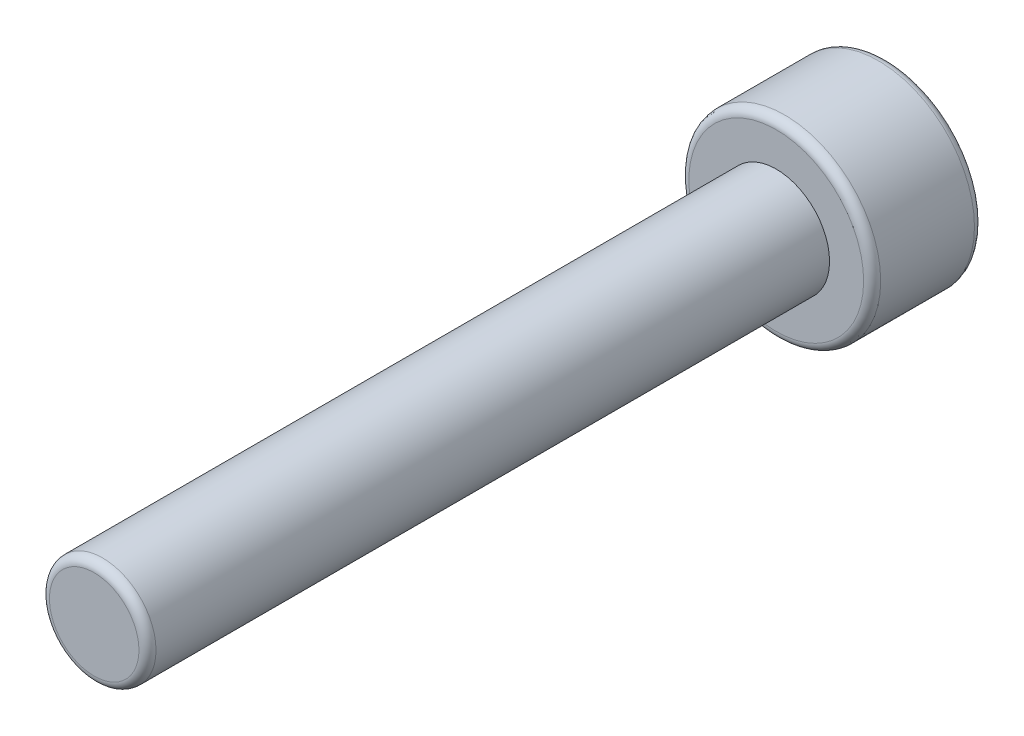
ISO-10303-21;
HEADER;
FILE_DESCRIPTION(('STEP AP214'),'2;1');
FILE_NAME('part.step','',(''),(''),'','','');
FILE_SCHEMA(('AUTOMOTIVE_DESIGN { 1 0 10303 214 1 1 1 1 }'));
ENDSEC;
DATA;
#1=APPLICATION_CONTEXT('core data for automotive mechanical design processes');
#2=APPLICATION_PROTOCOL_DEFINITION('international standard','automotive_design',2000,#1);
#3=PRODUCT_CONTEXT('',#1,'mechanical');
#4=PRODUCT('Part','Part','',(#3));
#5=PRODUCT_RELATED_PRODUCT_CATEGORY('part','',(#4));
#6=PRODUCT_DEFINITION_FORMATION('','',#4);
#7=PRODUCT_DEFINITION_CONTEXT('part definition',#1,'design');
#8=PRODUCT_DEFINITION('design','',#6,#7);
#9=PRODUCT_DEFINITION_SHAPE('','',#8);
#10=(LENGTH_UNIT() NAMED_UNIT(*) SI_UNIT(.MILLI.,.METRE.));
#11=(NAMED_UNIT(*) PLANE_ANGLE_UNIT() SI_UNIT($,.RADIAN.));
#12=(NAMED_UNIT(*) SI_UNIT($,.STERADIAN.) SOLID_ANGLE_UNIT());
#13=UNCERTAINTY_MEASURE_WITH_UNIT(LENGTH_MEASURE(1.E-05),#10,'distance_accuracy_value','');
#14=(GEOMETRIC_REPRESENTATION_CONTEXT(3) GLOBAL_UNCERTAINTY_ASSIGNED_CONTEXT((#13)) GLOBAL_UNIT_ASSIGNED_CONTEXT((#10,
#11,#12)) REPRESENTATION_CONTEXT('',''));
#15=CARTESIAN_POINT('',(0.,0.,0.));
#16=DIRECTION('',(0.,0.,1.));
#17=DIRECTION('',(1.,0.,0.));
#18=AXIS2_PLACEMENT_3D('',#15,#16,#17);
#19=CARTESIAN_POINT('',(0.,0.,16.));
#20=DIRECTION('',(0.,0.,-1.));
#21=DIRECTION('',(-1.,0.,0.));
#22=AXIS2_PLACEMENT_3D('',#19,#20,#21);
#23=CYLINDRICAL_SURFACE('',#22,1.25);
#24=CARTESIAN_POINT('',(0.,0.,15.8));
#25=DIRECTION('',(0.,0.,1.));
#26=DIRECTION('',(1.,0.,0.));
#27=AXIS2_PLACEMENT_3D('',#24,#25,#26);
#28=CIRCLE('',#27,1.25);
#29=CARTESIAN_POINT('',(1.25,0.,15.8));
#30=VERTEX_POINT('',#29);
#31=EDGE_CURVE('E173',#30,#30,#28,.F.);
#32=ORIENTED_EDGE('',*,*,#31,.T.);
#33=EDGE_LOOP('',(#32));
#34=FACE_BOUND('',#33,.T.);
#35=CARTESIAN_POINT('',(0.,0.,0.));
#36=DIRECTION('',(0.,0.,1.));
#37=DIRECTION('',(1.,0.,0.));
#38=AXIS2_PLACEMENT_3D('',#35,#36,#37);
#39=CIRCLE('',#38,1.25);
#40=CARTESIAN_POINT('',(1.25,0.,0.));
#41=VERTEX_POINT('',#40);
#42=EDGE_CURVE('E156',#41,#41,#39,.T.);
#43=ORIENTED_EDGE('',*,*,#42,.T.);
#44=EDGE_LOOP('',(#43));
#45=FACE_BOUND('',#44,.T.);
#46=ADVANCED_FACE('F41',(#34,#45),#23,.T.);
#47=CARTESIAN_POINT('',(0.,0.,16.));
#48=DIRECTION('',(0.,0.,1.));
#49=DIRECTION('',(1.,0.,0.));
#50=AXIS2_PLACEMENT_3D('',#47,#48,#49);
#51=PLANE('',#50);
#52=CARTESIAN_POINT('',(0.,0.,16.));
#53=DIRECTION('',(0.,0.,1.));
#54=DIRECTION('',(1.,0.,0.));
#55=AXIS2_PLACEMENT_3D('',#52,#53,#54);
#56=CIRCLE('',#55,1.05);
#57=CARTESIAN_POINT('',(1.05,0.,16.));
#58=VERTEX_POINT('',#57);
#59=EDGE_CURVE('E169',#58,#58,#56,.T.);
#60=ORIENTED_EDGE('',*,*,#59,.T.);
#61=EDGE_LOOP('',(#60));
#62=FACE_BOUND('',#61,.T.);
#63=ADVANCED_FACE('F206',(#62),#51,.T.);
#64=CARTESIAN_POINT('',(0.,0.,-2.6));
#65=DIRECTION('',(0.,0.,1.));
#66=DIRECTION('',(1.,0.,0.));
#67=AXIS2_PLACEMENT_3D('',#64,#65,#66);
#68=CYLINDRICAL_SURFACE('',#67,2.25);
#69=CARTESIAN_POINT('',(0.,0.,-0.2));
#70=DIRECTION('',(0.,0.,1.));
#71=DIRECTION('',(1.,0.,0.));
#72=AXIS2_PLACEMENT_3D('',#69,#70,#71);
#73=CIRCLE('',#72,2.25);
#74=CARTESIAN_POINT('',(2.25,0.,-0.2));
#75=VERTEX_POINT('',#74);
#76=EDGE_CURVE('E50',#75,#75,#73,.F.);
#77=ORIENTED_EDGE('',*,*,#76,.T.);
#78=EDGE_LOOP('',(#77));
#79=FACE_BOUND('',#78,.T.);
#80=CARTESIAN_POINT('',(0.,0.,-2.4));
#81=DIRECTION('',(0.,0.,1.));
#82=DIRECTION('',(1.,0.,0.));
#83=AXIS2_PLACEMENT_3D('',#80,#81,#82);
#84=CIRCLE('',#83,2.25);
#85=CARTESIAN_POINT('',(2.25,0.,-2.4));
#86=VERTEX_POINT('',#85);
#87=EDGE_CURVE('E181',#86,#86,#84,.T.);
#88=ORIENTED_EDGE('',*,*,#87,.T.);
#89=EDGE_LOOP('',(#88));
#90=FACE_BOUND('',#89,.T.);
#91=ADVANCED_FACE('F188',(#79,#90),#68,.T.);
#92=CARTESIAN_POINT('',(0.,0.,-2.6));
#93=DIRECTION('',(0.,0.,1.));
#94=DIRECTION('',(1.,0.,0.));
#95=AXIS2_PLACEMENT_3D('',#92,#93,#94);
#96=PLANE('',#95);
#97=CARTESIAN_POINT('',(0.,0.,-2.6));
#98=DIRECTION('',(0.,0.,1.));
#99=DIRECTION('',(1.,0.,0.));
#100=AXIS2_PLACEMENT_3D('',#97,#98,#99);
#101=CIRCLE('',#100,2.05);
#102=CARTESIAN_POINT('',(2.05,0.,-2.6));
#103=VERTEX_POINT('',#102);
#104=EDGE_CURVE('E11',#103,#103,#101,.F.);
#105=ORIENTED_EDGE('',*,*,#104,.T.);
#106=EDGE_LOOP('',(#105));
#107=FACE_BOUND('',#106,.T.);
#108=DIRECTION('',(0.866025403784439,-0.5,0.));
#109=VECTOR('',#108,1.);
#110=CARTESIAN_POINT('',(0.,1.15470053837925,-2.6));
#111=LINE('',#110,#109);
#112=CARTESIAN_POINT('',(0.,1.15470053837925,-2.6));
#113=VERTEX_POINT('',#112);
#114=CARTESIAN_POINT('',(1.,0.577350269189626,-2.6));
#115=VERTEX_POINT('',#114);
#116=EDGE_CURVE('E137',#113,#115,#111,.T.);
#117=ORIENTED_EDGE('',*,*,#116,.F.);
#118=DIRECTION('',(0.866025403784439,0.5,0.));
#119=VECTOR('',#118,1.);
#120=CARTESIAN_POINT('',(-0.999999999999999,0.577350269189626,-2.6));
#121=LINE('',#120,#119);
#122=CARTESIAN_POINT('',(-0.999999999999999,0.577350269189626,-2.6));
#123=VERTEX_POINT('',#122);
#124=EDGE_CURVE('E57',#123,#113,#121,.T.);
#125=ORIENTED_EDGE('',*,*,#124,.F.);
#126=DIRECTION('',(0.,1.,0.));
#127=VECTOR('',#126,1.);
#128=CARTESIAN_POINT('',(-0.999999999999999,-0.577350269189626,-2.6));
#129=LINE('',#128,#127);
#130=CARTESIAN_POINT('',(-0.999999999999999,-0.577350269189626,-2.6));
#131=VERTEX_POINT('',#130);
#132=EDGE_CURVE('E150',#131,#123,#129,.T.);
#133=ORIENTED_EDGE('',*,*,#132,.F.);
#134=DIRECTION('',(-0.866025403784439,0.5,0.));
#135=VECTOR('',#134,1.);
#136=CARTESIAN_POINT('',(0.,-1.15470053837925,-2.6));
#137=LINE('',#136,#135);
#138=CARTESIAN_POINT('',(0.,-1.15470053837925,-2.6));
#139=VERTEX_POINT('',#138);
#140=EDGE_CURVE('E147',#139,#131,#137,.T.);
#141=ORIENTED_EDGE('',*,*,#140,.F.);
#142=DIRECTION('',(-0.866025403784439,-0.5,0.));
#143=VECTOR('',#142,1.);
#144=CARTESIAN_POINT('',(1.,-0.577350269189626,-2.6));
#145=LINE('',#144,#143);
#146=CARTESIAN_POINT('',(1.,-0.577350269189626,-2.6));
#147=VERTEX_POINT('',#146);
#148=EDGE_CURVE('E105',#147,#139,#145,.T.);
#149=ORIENTED_EDGE('',*,*,#148,.F.);
#150=DIRECTION('',(0.,-1.,0.));
#151=VECTOR('',#150,1.);
#152=CARTESIAN_POINT('',(1.,0.577350269189626,-2.6));
#153=LINE('',#152,#151);
#154=EDGE_CURVE('E141',#115,#147,#153,.T.);
#155=ORIENTED_EDGE('',*,*,#154,.F.);
#156=EDGE_LOOP('',(#117,#125,#133,#141,#149,#155));
#157=FACE_BOUND('',#156,.T.);
#158=ADVANCED_FACE('F201',(#107,#157),#96,.F.);
#159=CARTESIAN_POINT('',(0.,0.,0.));
#160=DIRECTION('',(0.,0.,1.));
#161=DIRECTION('',(1.,0.,0.));
#162=AXIS2_PLACEMENT_3D('',#159,#160,#161);
#163=PLANE('',#162);
#164=CARTESIAN_POINT('',(0.,0.,0.));
#165=DIRECTION('',(0.,0.,1.));
#166=DIRECTION('',(1.,0.,0.));
#167=AXIS2_PLACEMENT_3D('',#164,#165,#166);
#168=CIRCLE('',#167,2.05);
#169=CARTESIAN_POINT('',(2.05,0.,0.));
#170=VERTEX_POINT('',#169);
#171=EDGE_CURVE('E177',#170,#170,#168,.T.);
#172=ORIENTED_EDGE('',*,*,#171,.T.);
#173=EDGE_LOOP('',(#172));
#174=FACE_BOUND('',#173,.T.);
#175=ORIENTED_EDGE('',*,*,#42,.F.);
#176=EDGE_LOOP('',(#175));
#177=FACE_BOUND('',#176,.T.);
#178=ADVANCED_FACE('F197',(#174,#177),#163,.T.);
#179=CARTESIAN_POINT('',(-0.999999999999999,0.577350269189626,-1.2));
#180=DIRECTION('',(-0.5,0.866025403784439,0.));
#181=DIRECTION('',(-0.866025403784439,-0.5,0.));
#182=AXIS2_PLACEMENT_3D('',#179,#180,#181);
#183=PLANE('',#182);
#184=ORIENTED_EDGE('',*,*,#124,.T.);
#185=DIRECTION('',(0.,0.,-1.));
#186=VECTOR('',#185,1.);
#187=CARTESIAN_POINT('',(0.,1.15470053837925,-1.2));
#188=LINE('',#187,#186);
#189=CARTESIAN_POINT('',(0.,1.15470053837925,-1.2));
#190=VERTEX_POINT('',#189);
#191=EDGE_CURVE('E87',#190,#113,#188,.T.);
#192=ORIENTED_EDGE('',*,*,#191,.F.);
#193=DIRECTION('',(0.866025403784439,0.5,0.));
#194=VECTOR('',#193,1.);
#195=CARTESIAN_POINT('',(-0.999999999999999,0.577350269189626,-1.2));
#196=LINE('',#195,#194);
#197=CARTESIAN_POINT('',(-0.999999999999999,0.577350269189626,-1.2));
#198=VERTEX_POINT('',#197);
#199=EDGE_CURVE('E153',#198,#190,#196,.T.);
#200=ORIENTED_EDGE('',*,*,#199,.F.);
#201=DIRECTION('',(0.,0.,-1.));
#202=VECTOR('',#201,1.);
#203=CARTESIAN_POINT('',(-0.999999999999999,0.577350269189626,-1.2));
#204=LINE('',#203,#202);
#205=EDGE_CURVE('E65',#198,#123,#204,.T.);
#206=ORIENTED_EDGE('',*,*,#205,.T.);
#207=EDGE_LOOP('',(#184,#192,#200,#206));
#208=FACE_BOUND('',#207,.T.);
#209=ADVANCED_FACE('F200',(#208),#183,.F.);
#210=CARTESIAN_POINT('',(-0.999999999999999,-0.577350269189626,-1.2));
#211=DIRECTION('',(-1.,0.,0.));
#212=DIRECTION('',(0.,0.,1.));
#213=AXIS2_PLACEMENT_3D('',#210,#211,#212);
#214=PLANE('',#213);
#215=ORIENTED_EDGE('',*,*,#132,.T.);
#216=ORIENTED_EDGE('',*,*,#205,.F.);
#217=DIRECTION('',(0.,1.,0.));
#218=VECTOR('',#217,1.);
#219=CARTESIAN_POINT('',(-0.999999999999999,-0.577350269189626,-1.2));
#220=LINE('',#219,#218);
#221=CARTESIAN_POINT('',(-0.999999999999999,-0.577350269189626,-1.2));
#222=VERTEX_POINT('',#221);
#223=EDGE_CURVE('E119',#222,#198,#220,.T.);
#224=ORIENTED_EDGE('',*,*,#223,.F.);
#225=DIRECTION('',(0.,0.,-1.));
#226=VECTOR('',#225,1.);
#227=CARTESIAN_POINT('',(-0.999999999999999,-0.577350269189626,-1.2));
#228=LINE('',#227,#226);
#229=EDGE_CURVE('E110',#222,#131,#228,.T.);
#230=ORIENTED_EDGE('',*,*,#229,.T.);
#231=EDGE_LOOP('',(#215,#216,#224,#230));
#232=FACE_BOUND('',#231,.T.);
#233=ADVANCED_FACE('F233',(#232),#214,.F.);
#234=CARTESIAN_POINT('',(0.,-1.15470053837925,-1.2));
#235=DIRECTION('',(-0.5,-0.866025403784439,0.));
#236=DIRECTION('',(0.866025403784439,-0.5,0.));
#237=AXIS2_PLACEMENT_3D('',#234,#235,#236);
#238=PLANE('',#237);
#239=ORIENTED_EDGE('',*,*,#140,.T.);
#240=ORIENTED_EDGE('',*,*,#229,.F.);
#241=DIRECTION('',(-0.866025403784439,0.5,0.));
#242=VECTOR('',#241,1.);
#243=CARTESIAN_POINT('',(0.,-1.15470053837925,-1.2));
#244=LINE('',#243,#242);
#245=CARTESIAN_POINT('',(0.,-1.15470053837925,-1.2));
#246=VERTEX_POINT('',#245);
#247=EDGE_CURVE('E114',#246,#222,#244,.T.);
#248=ORIENTED_EDGE('',*,*,#247,.F.);
#249=DIRECTION('',(0.,0.,-1.));
#250=VECTOR('',#249,1.);
#251=CARTESIAN_POINT('',(0.,-1.15470053837925,-1.2));
#252=LINE('',#251,#250);
#253=EDGE_CURVE('E98',#246,#139,#252,.T.);
#254=ORIENTED_EDGE('',*,*,#253,.T.);
#255=EDGE_LOOP('',(#239,#240,#248,#254));
#256=FACE_BOUND('',#255,.T.);
#257=ADVANCED_FACE('F115',(#256),#238,.F.);
#258=CARTESIAN_POINT('',(1.,-0.577350269189626,-1.2));
#259=DIRECTION('',(0.5,-0.866025403784438,0.));
#260=DIRECTION('',(0.866025403784439,0.5,0.));
#261=AXIS2_PLACEMENT_3D('',#258,#259,#260);
#262=PLANE('',#261);
#263=ORIENTED_EDGE('',*,*,#148,.T.);
#264=ORIENTED_EDGE('',*,*,#253,.F.);
#265=DIRECTION('',(-0.866025403784439,-0.5,0.));
#266=VECTOR('',#265,1.);
#267=CARTESIAN_POINT('',(1.,-0.577350269189626,-1.2));
#268=LINE('',#267,#266);
#269=CARTESIAN_POINT('',(1.,-0.577350269189626,-1.2));
#270=VERTEX_POINT('',#269);
#271=EDGE_CURVE('E102',#270,#246,#268,.T.);
#272=ORIENTED_EDGE('',*,*,#271,.F.);
#273=DIRECTION('',(0.,0.,-1.));
#274=VECTOR('',#273,1.);
#275=CARTESIAN_POINT('',(1.,-0.577350269189626,-1.2));
#276=LINE('',#275,#274);
#277=EDGE_CURVE('E111',#270,#147,#276,.T.);
#278=ORIENTED_EDGE('',*,*,#277,.T.);
#279=EDGE_LOOP('',(#263,#264,#272,#278));
#280=FACE_BOUND('',#279,.T.);
#281=ADVANCED_FACE('F100',(#280),#262,.F.);
#282=CARTESIAN_POINT('',(1.,0.577350269189626,-1.2));
#283=DIRECTION('',(1.,0.,0.));
#284=DIRECTION('',(0.,0.,-1.));
#285=AXIS2_PLACEMENT_3D('',#282,#283,#284);
#286=PLANE('',#285);
#287=ORIENTED_EDGE('',*,*,#154,.T.);
#288=ORIENTED_EDGE('',*,*,#277,.F.);
#289=DIRECTION('',(0.,-1.,0.));
#290=VECTOR('',#289,1.);
#291=CARTESIAN_POINT('',(1.,0.577350269189626,-1.2));
#292=LINE('',#291,#290);
#293=CARTESIAN_POINT('',(1.,0.577350269189626,-1.2));
#294=VERTEX_POINT('',#293);
#295=EDGE_CURVE('E125',#294,#270,#292,.T.);
#296=ORIENTED_EDGE('',*,*,#295,.F.);
#297=DIRECTION('',(0.,0.,-1.));
#298=VECTOR('',#297,1.);
#299=CARTESIAN_POINT('',(1.,0.577350269189626,-1.2));
#300=LINE('',#299,#298);
#301=EDGE_CURVE('E161',#294,#115,#300,.T.);
#302=ORIENTED_EDGE('',*,*,#301,.T.);
#303=EDGE_LOOP('',(#287,#288,#296,#302));
#304=FACE_BOUND('',#303,.T.);
#305=ADVANCED_FACE('F229',(#304),#286,.F.);
#306=CARTESIAN_POINT('',(0.,1.15470053837925,-1.2));
#307=DIRECTION('',(0.5,0.866025403784439,0.));
#308=DIRECTION('',(-0.866025403784439,0.5,0.));
#309=AXIS2_PLACEMENT_3D('',#306,#307,#308);
#310=PLANE('',#309);
#311=ORIENTED_EDGE('',*,*,#116,.T.);
#312=ORIENTED_EDGE('',*,*,#301,.F.);
#313=DIRECTION('',(0.866025403784439,-0.5,0.));
#314=VECTOR('',#313,1.);
#315=CARTESIAN_POINT('',(0.,1.15470053837925,-1.2));
#316=LINE('',#315,#314);
#317=EDGE_CURVE('E129',#190,#294,#316,.T.);
#318=ORIENTED_EDGE('',*,*,#317,.F.);
#319=ORIENTED_EDGE('',*,*,#191,.T.);
#320=EDGE_LOOP('',(#311,#312,#318,#319));
#321=FACE_BOUND('',#320,.T.);
#322=ADVANCED_FACE('F221',(#321),#310,.F.);
#323=CARTESIAN_POINT('',(0.,0.,-1.2));
#324=DIRECTION('',(0.,0.,-1.));
#325=DIRECTION('',(-1.,0.,0.));
#326=AXIS2_PLACEMENT_3D('',#323,#324,#325);
#327=PLANE('',#326);
#328=ORIENTED_EDGE('',*,*,#199,.T.);
#329=ORIENTED_EDGE('',*,*,#317,.T.);
#330=ORIENTED_EDGE('',*,*,#295,.T.);
#331=ORIENTED_EDGE('',*,*,#271,.T.);
#332=ORIENTED_EDGE('',*,*,#247,.T.);
#333=ORIENTED_EDGE('',*,*,#223,.T.);
#334=EDGE_LOOP('',(#328,#329,#330,#331,#332,#333));
#335=FACE_BOUND('',#334,.T.);
#336=ADVANCED_FACE('F122',(#335),#327,.T.);
#337=CARTESIAN_POINT('',(0.,0.,15.8));
#338=DIRECTION('',(0.,0.,1.));
#339=DIRECTION('',(1.,0.,0.));
#340=AXIS2_PLACEMENT_3D('',#337,#338,#339);
#341=TOROIDAL_SURFACE('',#340,1.05,0.2);
#342=ORIENTED_EDGE('',*,*,#31,.F.);
#343=EDGE_LOOP('',(#342));
#344=FACE_BOUND('',#343,.T.);
#345=ORIENTED_EDGE('',*,*,#59,.F.);
#346=EDGE_LOOP('',(#345));
#347=FACE_BOUND('',#346,.T.);
#348=ADVANCED_FACE('F194',(#344,#347),#341,.T.);
#349=CARTESIAN_POINT('',(0.,0.,-0.2));
#350=DIRECTION('',(0.,0.,1.));
#351=DIRECTION('',(1.,0.,0.));
#352=AXIS2_PLACEMENT_3D('',#349,#350,#351);
#353=TOROIDAL_SURFACE('',#352,2.05,0.2);
#354=ORIENTED_EDGE('',*,*,#76,.F.);
#355=EDGE_LOOP('',(#354));
#356=FACE_BOUND('',#355,.T.);
#357=ORIENTED_EDGE('',*,*,#171,.F.);
#358=EDGE_LOOP('',(#357));
#359=FACE_BOUND('',#358,.T.);
#360=ADVANCED_FACE('F191',(#356,#359),#353,.T.);
#361=CARTESIAN_POINT('',(0.,0.,-2.4));
#362=DIRECTION('',(0.,0.,1.));
#363=DIRECTION('',(1.,0.,0.));
#364=AXIS2_PLACEMENT_3D('',#361,#362,#363);
#365=TOROIDAL_SURFACE('',#364,2.05,0.2);
#366=ORIENTED_EDGE('',*,*,#104,.F.);
#367=EDGE_LOOP('',(#366));
#368=FACE_BOUND('',#367,.T.);
#369=ORIENTED_EDGE('',*,*,#87,.F.);
#370=EDGE_LOOP('',(#369));
#371=FACE_BOUND('',#370,.T.);
#372=ADVANCED_FACE('F43',(#368,#371),#365,.T.);
#373=CLOSED_SHELL('',(#46,#63,#91,#158,#178,#209,#233,#257,#281,#305,#322,#336,#348,#360,#372));
#374=MANIFOLD_SOLID_BREP('B2',#373);
#375=ADVANCED_BREP_SHAPE_REPRESENTATION('',(#18,#374),#14);
#376=SHAPE_DEFINITION_REPRESENTATION(#9,#375);
ENDSEC;
END-ISO-10303-21;
